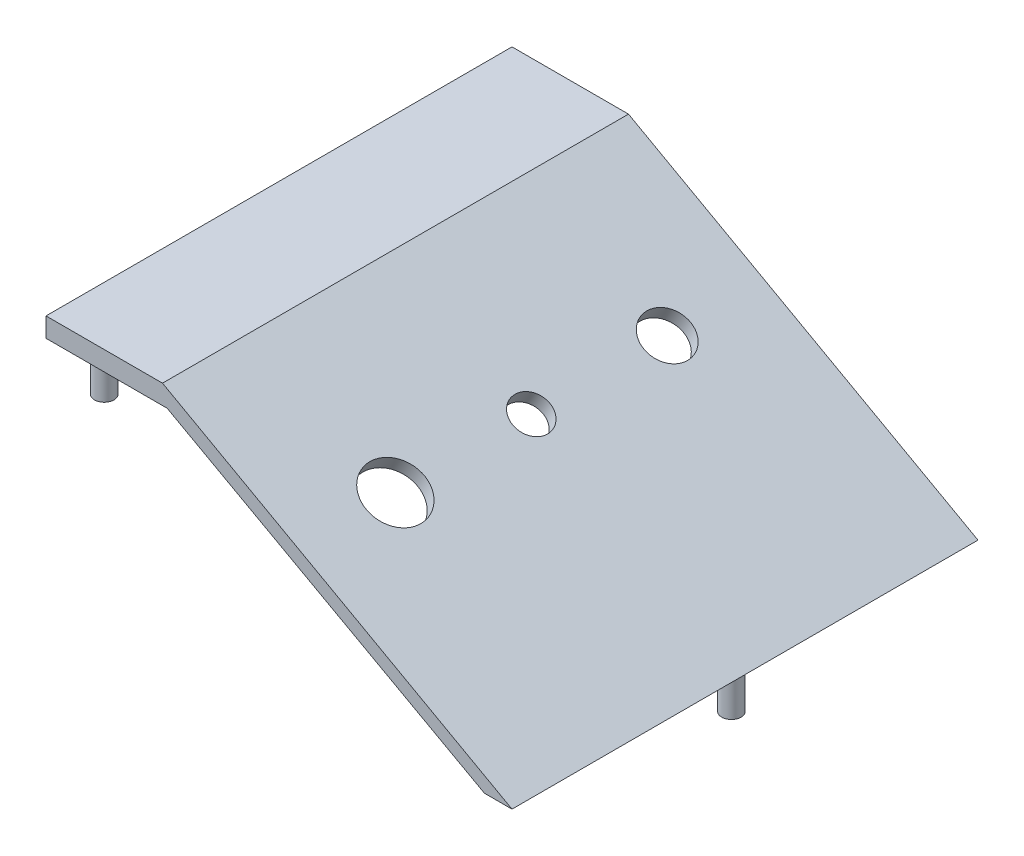
ISO-10303-21;
HEADER;
FILE_DESCRIPTION(('STEP AP214'),'2;1');
FILE_NAME('part.step','',(''),(''),'','','');
FILE_SCHEMA(('AUTOMOTIVE_DESIGN { 1 0 10303 214 1 1 1 1 }'));
ENDSEC;
DATA;
#1=APPLICATION_CONTEXT('core data for automotive mechanical design processes');
#2=APPLICATION_PROTOCOL_DEFINITION('international standard','automotive_design',2000,#1);
#3=PRODUCT_CONTEXT('',#1,'mechanical');
#4=PRODUCT('Part','Part','',(#3));
#5=PRODUCT_RELATED_PRODUCT_CATEGORY('part','',(#4));
#6=PRODUCT_DEFINITION_FORMATION('','',#4);
#7=PRODUCT_DEFINITION_CONTEXT('part definition',#1,'design');
#8=PRODUCT_DEFINITION('design','',#6,#7);
#9=PRODUCT_DEFINITION_SHAPE('','',#8);
#10=(LENGTH_UNIT() NAMED_UNIT(*) SI_UNIT(.MILLI.,.METRE.));
#11=(NAMED_UNIT(*) PLANE_ANGLE_UNIT() SI_UNIT($,.RADIAN.));
#12=(NAMED_UNIT(*) SI_UNIT($,.STERADIAN.) SOLID_ANGLE_UNIT());
#13=UNCERTAINTY_MEASURE_WITH_UNIT(LENGTH_MEASURE(1.E-05),#10,'distance_accuracy_value','');
#14=(GEOMETRIC_REPRESENTATION_CONTEXT(3) GLOBAL_UNCERTAINTY_ASSIGNED_CONTEXT((#13)) GLOBAL_UNIT_ASSIGNED_CONTEXT((#10,
#11,#12)) REPRESENTATION_CONTEXT('',''));
#15=CARTESIAN_POINT('',(0.,0.,0.));
#16=DIRECTION('',(0.,0.,1.));
#17=DIRECTION('',(1.,0.,0.));
#18=AXIS2_PLACEMENT_3D('',#15,#16,#17);
#19=CARTESIAN_POINT('',(0.,76.2,152.4));
#20=DIRECTION('',(0.,-1.,0.));
#21=DIRECTION('',(0.,0.,-1.));
#22=AXIS2_PLACEMENT_3D('',#19,#20,#21);
#23=PLANE('',#22);
#24=DIRECTION('',(-1.,0.,0.));
#25=VECTOR('',#24,1.);
#26=CARTESIAN_POINT('',(0.,76.2,152.4));
#27=LINE('',#26,#25);
#28=CARTESIAN_POINT('',(38.1,76.2,152.4));
#29=VERTEX_POINT('',#28);
#30=CARTESIAN_POINT('',(0.,76.2,152.4));
#31=VERTEX_POINT('',#30);
#32=EDGE_CURVE('E56',#29,#31,#27,.T.);
#33=ORIENTED_EDGE('',*,*,#32,.F.);
#34=DIRECTION('',(0.,0.,1.));
#35=VECTOR('',#34,1.);
#36=CARTESIAN_POINT('',(38.1,76.2,0.));
#37=LINE('',#36,#35);
#38=CARTESIAN_POINT('',(38.1,76.2,0.));
#39=VERTEX_POINT('',#38);
#40=EDGE_CURVE('E101',#39,#29,#37,.T.);
#41=ORIENTED_EDGE('',*,*,#40,.F.);
#42=DIRECTION('',(-1.,0.,0.));
#43=VECTOR('',#42,1.);
#44=CARTESIAN_POINT('',(0.,76.2,0.));
#45=LINE('',#44,#43);
#46=CARTESIAN_POINT('',(0.,76.2,0.));
#47=VERTEX_POINT('',#46);
#48=EDGE_CURVE('E100',#39,#47,#45,.T.);
#49=ORIENTED_EDGE('',*,*,#48,.T.);
#50=DIRECTION('',(0.,0.,-1.));
#51=VECTOR('',#50,1.);
#52=CARTESIAN_POINT('',(0.,76.2,152.4));
#53=LINE('',#52,#51);
#54=EDGE_CURVE('E118',#31,#47,#53,.T.);
#55=ORIENTED_EDGE('',*,*,#54,.F.);
#56=EDGE_LOOP('',(#33,#41,#49,#55));
#57=FACE_BOUND('',#56,.T.);
#58=ADVANCED_FACE('F33',(#57),#23,.F.);
#59=CARTESIAN_POINT('',(0.,0.,152.4));
#60=DIRECTION('',(1.,0.,0.));
#61=DIRECTION('',(0.,0.,-1.));
#62=AXIS2_PLACEMENT_3D('',#59,#60,#61);
#63=PLANE('',#62);
#64=DIRECTION('',(0.,-1.,0.));
#65=VECTOR('',#64,1.);
#66=CARTESIAN_POINT('',(0.,0.,0.));
#67=LINE('',#66,#65);
#68=CARTESIAN_POINT('',(0.,69.85,0.));
#69=VERTEX_POINT('',#68);
#70=EDGE_CURVE('E116',#47,#69,#67,.T.);
#71=ORIENTED_EDGE('',*,*,#70,.T.);
#72=DIRECTION('',(0.,0.,1.));
#73=VECTOR('',#72,1.);
#74=CARTESIAN_POINT('',(0.,69.85,0.));
#75=LINE('',#74,#73);
#76=CARTESIAN_POINT('',(0.,69.85,152.4));
#77=VERTEX_POINT('',#76);
#78=EDGE_CURVE('E111',#69,#77,#75,.T.);
#79=ORIENTED_EDGE('',*,*,#78,.T.);
#80=DIRECTION('',(0.,-1.,0.));
#81=VECTOR('',#80,1.);
#82=CARTESIAN_POINT('',(0.,0.,152.4));
#83=LINE('',#82,#81);
#84=EDGE_CURVE('E115',#31,#77,#83,.T.);
#85=ORIENTED_EDGE('',*,*,#84,.F.);
#86=ORIENTED_EDGE('',*,*,#54,.T.);
#87=EDGE_LOOP('',(#71,#79,#85,#86));
#88=FACE_BOUND('',#87,.T.);
#89=ADVANCED_FACE('F160',(#88),#63,.F.);
#90=CARTESIAN_POINT('',(0.,0.,152.4));
#91=DIRECTION('',(0.,0.,-1.));
#92=DIRECTION('',(-1.,0.,0.));
#93=AXIS2_PLACEMENT_3D('',#90,#91,#92);
#94=PLANE('',#93);
#95=DIRECTION('',(-0.875916140325054,0.482463382152533,0.));
#96=VECTOR('',#95,1.);
#97=CARTESIAN_POINT('',(39.6253542076336,69.85,152.4));
#98=LINE('',#97,#96);
#99=CARTESIAN_POINT('',(143.381637630094,12.7,152.4));
#100=VERTEX_POINT('',#99);
#101=CARTESIAN_POINT('',(39.6253542076336,69.85,152.4));
#102=VERTEX_POINT('',#101);
#103=EDGE_CURVE('E156',#100,#102,#98,.T.);
#104=ORIENTED_EDGE('',*,*,#103,.F.);
#105=DIRECTION('',(-1.,0.,0.));
#106=VECTOR('',#105,1.);
#107=CARTESIAN_POINT('',(152.4,12.7,152.4));
#108=LINE('',#107,#106);
#109=CARTESIAN_POINT('',(152.4,12.7,152.4));
#110=VERTEX_POINT('',#109);
#111=EDGE_CURVE('E47',#110,#100,#108,.T.);
#112=ORIENTED_EDGE('',*,*,#111,.F.);
#113=DIRECTION('',(0.874157276121538,-0.485642931178632,0.));
#114=VECTOR('',#113,1.);
#115=CARTESIAN_POINT('',(38.1,76.2,152.4));
#116=LINE('',#115,#114);
#117=EDGE_CURVE('E99',#29,#110,#116,.T.);
#118=ORIENTED_EDGE('',*,*,#117,.F.);
#119=ORIENTED_EDGE('',*,*,#32,.T.);
#120=ORIENTED_EDGE('',*,*,#84,.T.);
#121=DIRECTION('',(-1.,0.,0.));
#122=VECTOR('',#121,1.);
#123=CARTESIAN_POINT('',(39.6253542076336,69.85,152.4));
#124=LINE('',#123,#122);
#125=EDGE_CURVE('E135',#102,#77,#124,.T.);
#126=ORIENTED_EDGE('',*,*,#125,.F.);
#127=EDGE_LOOP('',(#104,#112,#118,#119,#120,#126));
#128=FACE_BOUND('',#127,.T.);
#129=ADVANCED_FACE('F162',(#128),#94,.F.);
#130=CARTESIAN_POINT('',(0.,0.,0.));
#131=DIRECTION('',(0.,0.,-1.));
#132=DIRECTION('',(-1.,0.,0.));
#133=AXIS2_PLACEMENT_3D('',#130,#131,#132);
#134=PLANE('',#133);
#135=DIRECTION('',(-1.,0.,0.));
#136=VECTOR('',#135,1.);
#137=CARTESIAN_POINT('',(152.4,12.7,0.));
#138=LINE('',#137,#136);
#139=CARTESIAN_POINT('',(152.4,12.7,0.));
#140=VERTEX_POINT('',#139);
#141=CARTESIAN_POINT('',(143.381637630094,12.7,0.));
#142=VERTEX_POINT('',#141);
#143=EDGE_CURVE('E85',#140,#142,#138,.T.);
#144=ORIENTED_EDGE('',*,*,#143,.T.);
#145=DIRECTION('',(-0.875916140325054,0.482463382152533,0.));
#146=VECTOR('',#145,1.);
#147=CARTESIAN_POINT('',(39.6253542076336,69.85,0.));
#148=LINE('',#147,#146);
#149=CARTESIAN_POINT('',(39.6253542076336,69.85,0.));
#150=VERTEX_POINT('',#149);
#151=EDGE_CURVE('E161',#142,#150,#148,.T.);
#152=ORIENTED_EDGE('',*,*,#151,.T.);
#153=DIRECTION('',(-1.,0.,0.));
#154=VECTOR('',#153,1.);
#155=CARTESIAN_POINT('',(39.6253542076336,69.85,0.));
#156=LINE('',#155,#154);
#157=EDGE_CURVE('E176',#150,#69,#156,.T.);
#158=ORIENTED_EDGE('',*,*,#157,.T.);
#159=ORIENTED_EDGE('',*,*,#70,.F.);
#160=ORIENTED_EDGE('',*,*,#48,.F.);
#161=DIRECTION('',(0.874157276121538,-0.485642931178632,0.));
#162=VECTOR('',#161,1.);
#163=CARTESIAN_POINT('',(38.1,76.2,0.));
#164=LINE('',#163,#162);
#165=EDGE_CURVE('E97',#39,#140,#164,.T.);
#166=ORIENTED_EDGE('',*,*,#165,.T.);
#167=EDGE_LOOP('',(#144,#152,#158,#159,#160,#166));
#168=FACE_BOUND('',#167,.T.);
#169=ADVANCED_FACE('F104',(#168),#134,.T.);
#170=CARTESIAN_POINT('',(38.1,76.2,0.));
#171=DIRECTION('',(-0.485642931178632,-0.874157276121538,0.));
#172=DIRECTION('',(0.874157276121538,-0.485642931178632,0.));
#173=AXIS2_PLACEMENT_3D('',#170,#171,#172);
#174=PLANE('',#173);
#175=CARTESIAN_POINT('',(82.5071896269741,51.5293390961255,120.65));
#176=DIRECTION('',(0.485642931178632,0.874157276121538,0.));
#177=DIRECTION('',(-0.874157276121538,0.485642931178632,0.));
#178=AXIS2_PLACEMENT_3D('',#175,#176,#177);
#179=CIRCLE('',#178,9.52500000000001);
#180=CARTESIAN_POINT('',(74.1808415719165,56.155088015602,120.65));
#181=VERTEX_POINT('',#180);
#182=EDGE_CURVE('E129',#181,#181,#179,.T.);
#183=ORIENTED_EDGE('',*,*,#182,.F.);
#184=EDGE_LOOP('',(#183));
#185=FACE_BOUND('',#184,.T.);
#186=CARTESIAN_POINT('',(82.5071896269741,51.5293390961255,76.2));
#187=DIRECTION('',(0.485642931178632,0.874157276121538,0.));
#188=DIRECTION('',(-0.874157276121538,0.485642931178632,0.));
#189=AXIS2_PLACEMENT_3D('',#186,#187,#188);
#190=CIRCLE('',#189,6.09600000000001);
#191=CARTESIAN_POINT('',(77.1783268717372,54.4898184045905,76.2));
#192=VERTEX_POINT('',#191);
#193=EDGE_CURVE('E184',#192,#192,#190,.T.);
#194=ORIENTED_EDGE('',*,*,#193,.F.);
#195=EDGE_LOOP('',(#194));
#196=FACE_BOUND('',#195,.T.);
#197=CARTESIAN_POINT('',(82.5071896269741,51.5293390961255,31.75));
#198=DIRECTION('',(0.485642931178632,0.874157276121538,0.));
#199=DIRECTION('',(-0.874157276121538,0.485642931178632,0.));
#200=AXIS2_PLACEMENT_3D('',#197,#198,#199);
#201=CIRCLE('',#200,7.62);
#202=CARTESIAN_POINT('',(75.846111182928,55.2299382317067,31.75));
#203=VERTEX_POINT('',#202);
#204=EDGE_CURVE('E181',#203,#203,#201,.T.);
#205=ORIENTED_EDGE('',*,*,#204,.F.);
#206=EDGE_LOOP('',(#205));
#207=FACE_BOUND('',#206,.T.);
#208=ORIENTED_EDGE('',*,*,#117,.T.);
#209=DIRECTION('',(0.,0.,1.));
#210=VECTOR('',#209,1.);
#211=CARTESIAN_POINT('',(152.4,12.7,0.));
#212=LINE('',#211,#210);
#213=EDGE_CURVE('E88',#140,#110,#212,.T.);
#214=ORIENTED_EDGE('',*,*,#213,.F.);
#215=ORIENTED_EDGE('',*,*,#165,.F.);
#216=ORIENTED_EDGE('',*,*,#40,.T.);
#217=EDGE_LOOP('',(#208,#214,#215,#216));
#218=FACE_BOUND('',#217,.T.);
#219=ADVANCED_FACE('F96',(#185,#196,#207,#218),#174,.F.);
#220=CARTESIAN_POINT('',(39.6253542076336,69.85,0.));
#221=DIRECTION('',(0.,1.,0.));
#222=DIRECTION('',(0.,0.,1.));
#223=AXIS2_PLACEMENT_3D('',#220,#221,#222);
#224=PLANE('',#223);
#225=CARTESIAN_POINT('',(12.7,69.85,146.05));
#226=DIRECTION('',(0.,1.,0.));
#227=DIRECTION('',(0.,0.,1.));
#228=AXIS2_PLACEMENT_3D('',#225,#226,#227);
#229=CIRCLE('',#228,3.175);
#230=CARTESIAN_POINT('',(12.7,69.85,149.225));
#231=VERTEX_POINT('',#230);
#232=EDGE_CURVE('E40',#231,#231,#229,.F.);
#233=ORIENTED_EDGE('',*,*,#232,.F.);
#234=EDGE_LOOP('',(#233));
#235=FACE_BOUND('',#234,.T.);
#236=CARTESIAN_POINT('',(12.7,69.85,6.35));
#237=DIRECTION('',(0.,1.,0.));
#238=DIRECTION('',(0.,0.,1.));
#239=AXIS2_PLACEMENT_3D('',#236,#237,#238);
#240=CIRCLE('',#239,3.175);
#241=CARTESIAN_POINT('',(12.7,69.85,9.525));
#242=VERTEX_POINT('',#241);
#243=EDGE_CURVE('E124',#242,#242,#240,.F.);
#244=ORIENTED_EDGE('',*,*,#243,.F.);
#245=EDGE_LOOP('',(#244));
#246=FACE_BOUND('',#245,.T.);
#247=ORIENTED_EDGE('',*,*,#125,.T.);
#248=ORIENTED_EDGE('',*,*,#78,.F.);
#249=ORIENTED_EDGE('',*,*,#157,.F.);
#250=DIRECTION('',(0.,0.,1.));
#251=VECTOR('',#250,1.);
#252=CARTESIAN_POINT('',(39.6253542076336,69.85,0.));
#253=LINE('',#252,#251);
#254=EDGE_CURVE('E108',#150,#102,#253,.T.);
#255=ORIENTED_EDGE('',*,*,#254,.T.);
#256=EDGE_LOOP('',(#247,#248,#249,#255));
#257=FACE_BOUND('',#256,.T.);
#258=ADVANCED_FACE('F142',(#235,#246,#257),#224,.F.);
#259=CARTESIAN_POINT('',(39.6253542076336,69.85,0.));
#260=DIRECTION('',(0.482463382152533,0.875916140325054,0.));
#261=DIRECTION('',(-0.875916140325054,0.482463382152533,0.));
#262=AXIS2_PLACEMENT_3D('',#259,#260,#261);
#263=PLANE('',#262);
#264=CARTESIAN_POINT('',(80.2530374573823,47.4718651908601,120.65));
#265=DIRECTION('',(0.482463382152533,0.875916140325054,0.));
#266=DIRECTION('',(0.875916140325054,-0.482463382152533,0.));
#267=AXIS2_PLACEMENT_3D('',#264,#265,#266);
#268=ELLIPSE('',#267,9.52506288034697,9.52500000000001);
#269=CARTESIAN_POINT('',(88.5961937718892,42.8763711383924,120.65));
#270=VERTEX_POINT('',#269);
#271=EDGE_CURVE('E132',#270,#270,#268,.T.);
#272=ORIENTED_EDGE('',*,*,#271,.T.);
#273=EDGE_LOOP('',(#272));
#274=FACE_BOUND('',#273,.T.);
#275=CARTESIAN_POINT('',(80.2530374573823,47.4718651908601,76.2));
#276=DIRECTION('',(0.482463382152533,0.875916140325054,0.));
#277=DIRECTION('',(0.875916140325054,-0.482463382152533,0.));
#278=AXIS2_PLACEMENT_3D('',#275,#276,#277);
#279=ELLIPSE('',#278,6.09604024342206,6.09600000000001);
#280=CARTESIAN_POINT('',(85.5926574986667,44.5307489972808,76.2));
#281=VERTEX_POINT('',#280);
#282=EDGE_CURVE('E128',#281,#281,#279,.T.);
#283=ORIENTED_EDGE('',*,*,#282,.T.);
#284=EDGE_LOOP('',(#283));
#285=FACE_BOUND('',#284,.T.);
#286=CARTESIAN_POINT('',(80.2530374573823,47.4718651908601,31.75));
#287=DIRECTION('',(0.482463382152533,0.875916140325054,0.));
#288=DIRECTION('',(0.875916140325054,-0.482463382152533,0.));
#289=AXIS2_PLACEMENT_3D('',#286,#287,#288);
#290=ELLIPSE('',#289,7.62005030427756,7.62);
#291=CARTESIAN_POINT('',(86.9275625089878,43.7954699488859,31.75));
#292=VERTEX_POINT('',#291);
#293=EDGE_CURVE('E125',#292,#292,#290,.T.);
#294=ORIENTED_EDGE('',*,*,#293,.T.);
#295=EDGE_LOOP('',(#294));
#296=FACE_BOUND('',#295,.T.);
#297=ORIENTED_EDGE('',*,*,#151,.F.);
#298=DIRECTION('',(0.,0.,1.));
#299=VECTOR('',#298,1.);
#300=CARTESIAN_POINT('',(143.381637630094,12.7,0.));
#301=LINE('',#300,#299);
#302=EDGE_CURVE('E89',#142,#100,#301,.T.);
#303=ORIENTED_EDGE('',*,*,#302,.T.);
#304=ORIENTED_EDGE('',*,*,#103,.T.);
#305=ORIENTED_EDGE('',*,*,#254,.F.);
#306=EDGE_LOOP('',(#297,#303,#304,#305));
#307=FACE_BOUND('',#306,.T.);
#308=ADVANCED_FACE('F145',(#274,#285,#296,#307),#263,.F.);
#309=CARTESIAN_POINT('',(70.1718591750369,29.3257442826385,31.75));
#310=DIRECTION('',(0.485642931178632,0.874157276121538,0.));
#311=DIRECTION('',(-0.874157276121538,0.485642931178632,0.));
#312=AXIS2_PLACEMENT_3D('',#309,#310,#311);
#313=CYLINDRICAL_SURFACE('',#312,7.62);
#314=ORIENTED_EDGE('',*,*,#204,.T.);
#315=EDGE_LOOP('',(#314));
#316=FACE_BOUND('',#315,.T.);
#317=ORIENTED_EDGE('',*,*,#293,.F.);
#318=EDGE_LOOP('',(#317));
#319=FACE_BOUND('',#318,.T.);
#320=ADVANCED_FACE('F237',(#316,#319),#313,.F.);
#321=CARTESIAN_POINT('',(70.1718591750369,29.3257442826385,76.2));
#322=DIRECTION('',(0.485642931178632,0.874157276121538,0.));
#323=DIRECTION('',(-0.874157276121538,0.485642931178632,0.));
#324=AXIS2_PLACEMENT_3D('',#321,#322,#323);
#325=CYLINDRICAL_SURFACE('',#324,6.09600000000001);
#326=ORIENTED_EDGE('',*,*,#193,.T.);
#327=EDGE_LOOP('',(#326));
#328=FACE_BOUND('',#327,.T.);
#329=ORIENTED_EDGE('',*,*,#282,.F.);
#330=EDGE_LOOP('',(#329));
#331=FACE_BOUND('',#330,.T.);
#332=ADVANCED_FACE('F233',(#328,#331),#325,.F.);
#333=CARTESIAN_POINT('',(70.1718591750369,29.3257442826385,120.65));
#334=DIRECTION('',(0.485642931178632,0.874157276121538,0.));
#335=DIRECTION('',(-0.874157276121538,0.485642931178632,0.));
#336=AXIS2_PLACEMENT_3D('',#333,#334,#335);
#337=CYLINDRICAL_SURFACE('',#336,9.52500000000001);
#338=ORIENTED_EDGE('',*,*,#182,.T.);
#339=EDGE_LOOP('',(#338));
#340=FACE_BOUND('',#339,.T.);
#341=ORIENTED_EDGE('',*,*,#271,.F.);
#342=EDGE_LOOP('',(#341));
#343=FACE_BOUND('',#342,.T.);
#344=ADVANCED_FACE('F229',(#340,#343),#337,.F.);
#345=CARTESIAN_POINT('',(12.7,57.15,6.35));
#346=DIRECTION('',(0.,1.,0.));
#347=DIRECTION('',(0.,0.,1.));
#348=AXIS2_PLACEMENT_3D('',#345,#346,#347);
#349=CYLINDRICAL_SURFACE('',#348,3.175);
#350=CARTESIAN_POINT('',(12.7,57.15,6.35));
#351=DIRECTION('',(0.,-1.,0.));
#352=DIRECTION('',(0.,0.,-1.));
#353=AXIS2_PLACEMENT_3D('',#350,#351,#352);
#354=CIRCLE('',#353,3.175);
#355=CARTESIAN_POINT('',(12.7,57.15,3.175));
#356=VERTEX_POINT('',#355);
#357=EDGE_CURVE('E185',#356,#356,#354,.T.);
#358=ORIENTED_EDGE('',*,*,#357,.F.);
#359=EDGE_LOOP('',(#358));
#360=FACE_BOUND('',#359,.T.);
#361=ORIENTED_EDGE('',*,*,#243,.T.);
#362=EDGE_LOOP('',(#361));
#363=FACE_BOUND('',#362,.T.);
#364=ADVANCED_FACE('F225',(#360,#363),#349,.T.);
#365=CARTESIAN_POINT('',(12.7,57.15,6.35));
#366=DIRECTION('',(0.,-1.,0.));
#367=DIRECTION('',(0.,0.,-1.));
#368=AXIS2_PLACEMENT_3D('',#365,#366,#367);
#369=PLANE('',#368);
#370=ORIENTED_EDGE('',*,*,#357,.T.);
#371=EDGE_LOOP('',(#370));
#372=FACE_BOUND('',#371,.T.);
#373=ADVANCED_FACE('F221',(#372),#369,.T.);
#374=CARTESIAN_POINT('',(12.7,57.15,146.05));
#375=DIRECTION('',(0.,1.,0.));
#376=DIRECTION('',(0.,0.,1.));
#377=AXIS2_PLACEMENT_3D('',#374,#375,#376);
#378=CYLINDRICAL_SURFACE('',#377,3.175);
#379=CARTESIAN_POINT('',(12.7,57.15,146.05));
#380=DIRECTION('',(0.,-1.,0.));
#381=DIRECTION('',(0.,0.,-1.));
#382=AXIS2_PLACEMENT_3D('',#379,#380,#381);
#383=CIRCLE('',#382,3.175);
#384=CARTESIAN_POINT('',(12.7,57.15,142.875));
#385=VERTEX_POINT('',#384);
#386=EDGE_CURVE('E192',#385,#385,#383,.T.);
#387=ORIENTED_EDGE('',*,*,#386,.F.);
#388=EDGE_LOOP('',(#387));
#389=FACE_BOUND('',#388,.T.);
#390=ORIENTED_EDGE('',*,*,#232,.T.);
#391=EDGE_LOOP('',(#390));
#392=FACE_BOUND('',#391,.T.);
#393=ADVANCED_FACE('F140',(#389,#392),#378,.T.);
#394=CARTESIAN_POINT('',(12.7,57.15,146.05));
#395=DIRECTION('',(0.,-1.,0.));
#396=DIRECTION('',(0.,0.,-1.));
#397=AXIS2_PLACEMENT_3D('',#394,#395,#396);
#398=PLANE('',#397);
#399=ORIENTED_EDGE('',*,*,#386,.T.);
#400=EDGE_LOOP('',(#399));
#401=FACE_BOUND('',#400,.T.);
#402=ADVANCED_FACE('F210',(#401),#398,.T.);
#403=CARTESIAN_POINT('',(152.4,12.7,0.));
#404=DIRECTION('',(0.,1.,0.));
#405=DIRECTION('',(-1.,0.,0.));
#406=AXIS2_PLACEMENT_3D('',#403,#404,#405);
#407=PLANE('',#406);
#408=CARTESIAN_POINT('',(147.955,12.7,76.2));
#409=DIRECTION('',(0.,1.,0.));
#410=DIRECTION('',(-1.,0.,0.));
#411=AXIS2_PLACEMENT_3D('',#408,#409,#410);
#412=CIRCLE('',#411,3.17499999999997);
#413=CARTESIAN_POINT('',(144.78,12.7,76.2));
#414=VERTEX_POINT('',#413);
#415=EDGE_CURVE('E11',#414,#414,#412,.F.);
#416=ORIENTED_EDGE('',*,*,#415,.F.);
#417=EDGE_LOOP('',(#416));
#418=FACE_BOUND('',#417,.T.);
#419=ORIENTED_EDGE('',*,*,#111,.T.);
#420=ORIENTED_EDGE('',*,*,#302,.F.);
#421=ORIENTED_EDGE('',*,*,#143,.F.);
#422=ORIENTED_EDGE('',*,*,#213,.T.);
#423=EDGE_LOOP('',(#419,#420,#421,#422));
#424=FACE_BOUND('',#423,.T.);
#425=ADVANCED_FACE('F87',(#418,#424),#407,.F.);
#426=CARTESIAN_POINT('',(147.955,0.,76.2));
#427=DIRECTION('',(0.,1.,0.));
#428=DIRECTION('',(-1.,0.,0.));
#429=AXIS2_PLACEMENT_3D('',#426,#427,#428);
#430=CYLINDRICAL_SURFACE('',#429,3.17499999999997);
#431=CARTESIAN_POINT('',(147.955,0.,76.2));
#432=DIRECTION('',(0.,-1.,0.));
#433=DIRECTION('',(1.,0.,0.));
#434=AXIS2_PLACEMENT_3D('',#431,#432,#433);
#435=CIRCLE('',#434,3.17499999999997);
#436=CARTESIAN_POINT('',(151.13,0.,76.2));
#437=VERTEX_POINT('',#436);
#438=EDGE_CURVE('E196',#437,#437,#435,.T.);
#439=ORIENTED_EDGE('',*,*,#438,.F.);
#440=EDGE_LOOP('',(#439));
#441=FACE_BOUND('',#440,.T.);
#442=ORIENTED_EDGE('',*,*,#415,.T.);
#443=EDGE_LOOP('',(#442));
#444=FACE_BOUND('',#443,.T.);
#445=ADVANCED_FACE('F203',(#441,#444),#430,.T.);
#446=CARTESIAN_POINT('',(147.955,0.,76.2));
#447=DIRECTION('',(0.,-1.,0.));
#448=DIRECTION('',(1.,0.,0.));
#449=AXIS2_PLACEMENT_3D('',#446,#447,#448);
#450=PLANE('',#449);
#451=ORIENTED_EDGE('',*,*,#438,.T.);
#452=EDGE_LOOP('',(#451));
#453=FACE_BOUND('',#452,.T.);
#454=ADVANCED_FACE('F201',(#453),#450,.T.);
#455=CLOSED_SHELL('',(#58,#89,#129,#169,#219,#258,#308,#320,#332,#344,#364,#373,#393,#402,#425,
#445,#454));
#456=MANIFOLD_SOLID_BREP('B2',#455);
#457=ADVANCED_BREP_SHAPE_REPRESENTATION('',(#18,#456),#14);
#458=SHAPE_DEFINITION_REPRESENTATION(#9,#457);
ENDSEC;
END-ISO-10303-21;
